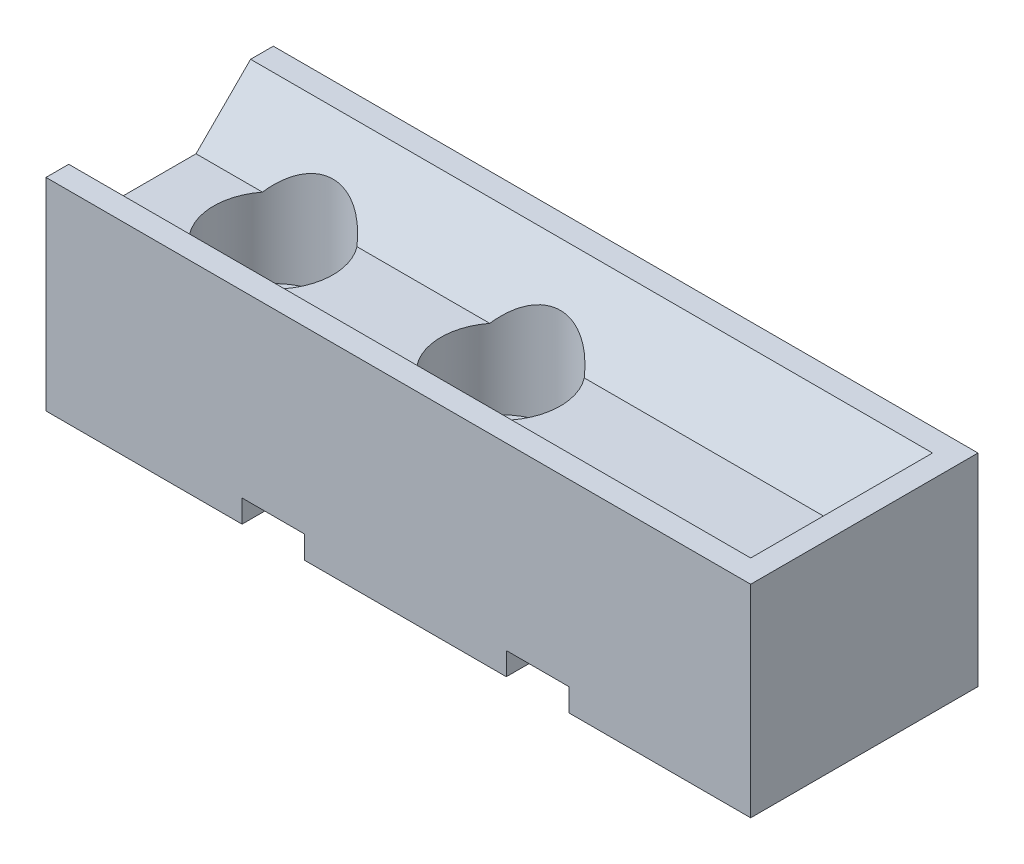
ISO-10303-21;
HEADER;
FILE_DESCRIPTION(('STEP AP214'),'2;1');
FILE_NAME('part.step','',(''),(''),'','','');
FILE_SCHEMA(('AUTOMOTIVE_DESIGN { 1 0 10303 214 1 1 1 1 }'));
ENDSEC;
DATA;
#1=APPLICATION_CONTEXT('core data for automotive mechanical design processes');
#2=APPLICATION_PROTOCOL_DEFINITION('international standard','automotive_design',2000,#1);
#3=PRODUCT_CONTEXT('',#1,'mechanical');
#4=PRODUCT('Part','Part','',(#3));
#5=PRODUCT_RELATED_PRODUCT_CATEGORY('part','',(#4));
#6=PRODUCT_DEFINITION_FORMATION('','',#4);
#7=PRODUCT_DEFINITION_CONTEXT('part definition',#1,'design');
#8=PRODUCT_DEFINITION('design','',#6,#7);
#9=PRODUCT_DEFINITION_SHAPE('','',#8);
#10=(LENGTH_UNIT() NAMED_UNIT(*) SI_UNIT(.MILLI.,.METRE.));
#11=(NAMED_UNIT(*) PLANE_ANGLE_UNIT() SI_UNIT($,.RADIAN.));
#12=(NAMED_UNIT(*) SI_UNIT($,.STERADIAN.) SOLID_ANGLE_UNIT());
#13=UNCERTAINTY_MEASURE_WITH_UNIT(LENGTH_MEASURE(1.E-05),#10,'distance_accuracy_value','');
#14=(GEOMETRIC_REPRESENTATION_CONTEXT(3) GLOBAL_UNCERTAINTY_ASSIGNED_CONTEXT((#13)) GLOBAL_UNIT_ASSIGNED_CONTEXT((#10,
#11,#12)) REPRESENTATION_CONTEXT('',''));
#15=CARTESIAN_POINT('',(0.,0.,0.));
#16=DIRECTION('',(0.,0.,1.));
#17=DIRECTION('',(1.,0.,0.));
#18=AXIS2_PLACEMENT_3D('',#15,#16,#17);
#19=CARTESIAN_POINT('',(0.,0.,0.));
#20=DIRECTION('',(0.,-1.,0.));
#21=DIRECTION('',(0.,0.,-1.));
#22=AXIS2_PLACEMENT_3D('',#19,#20,#21);
#23=PLANE('',#22);
#24=DIRECTION('',(0.,0.,-1.));
#25=VECTOR('',#24,1.);
#26=CARTESIAN_POINT('',(-13.75,0.,10.));
#27=LINE('',#26,#25);
#28=CARTESIAN_POINT('',(-13.75,0.,10.));
#29=VERTEX_POINT('',#28);
#30=CARTESIAN_POINT('',(-13.75,0.,-10.));
#31=VERTEX_POINT('',#30);
#32=EDGE_CURVE('E206',#29,#31,#27,.T.);
#33=ORIENTED_EDGE('',*,*,#32,.F.);
#34=DIRECTION('',(1.,0.,0.));
#35=VECTOR('',#34,1.);
#36=CARTESIAN_POINT('',(-31.,0.,10.));
#37=LINE('',#36,#35);
#38=CARTESIAN_POINT('',(-31.,0.,10.));
#39=VERTEX_POINT('',#38);
#40=EDGE_CURVE('E198',#39,#29,#37,.T.);
#41=ORIENTED_EDGE('',*,*,#40,.F.);
#42=DIRECTION('',(0.,0.,1.));
#43=VECTOR('',#42,1.);
#44=CARTESIAN_POINT('',(-31.,0.,10.));
#45=LINE('',#44,#43);
#46=CARTESIAN_POINT('',(-31.,0.,-10.));
#47=VERTEX_POINT('',#46);
#48=EDGE_CURVE('E368',#47,#39,#45,.T.);
#49=ORIENTED_EDGE('',*,*,#48,.F.);
#50=DIRECTION('',(-1.,0.,0.));
#51=VECTOR('',#50,1.);
#52=CARTESIAN_POINT('',(-31.,0.,-10.));
#53=LINE('',#52,#51);
#54=EDGE_CURVE('E365',#31,#47,#53,.T.);
#55=ORIENTED_EDGE('',*,*,#54,.F.);
#56=EDGE_LOOP('',(#33,#41,#49,#55));
#57=FACE_BOUND('',#56,.T.);
#58=CARTESIAN_POINT('',(-21.,0.,0.));
#59=DIRECTION('',(0.,1.,0.));
#60=DIRECTION('',(0.,0.,1.));
#61=AXIS2_PLACEMENT_3D('',#58,#59,#60);
#62=CIRCLE('',#61,2.75);
#63=CARTESIAN_POINT('',(-21.,0.,2.75));
#64=VERTEX_POINT('',#63);
#65=EDGE_CURVE('E260',#64,#64,#62,.T.);
#66=ORIENTED_EDGE('',*,*,#65,.T.);
#67=EDGE_LOOP('',(#66));
#68=FACE_BOUND('',#67,.T.);
#69=ADVANCED_FACE('F35',(#57,#68),#23,.T.);
#70=DIRECTION('',(0.,0.,-1.));
#71=VECTOR('',#70,1.);
#72=CARTESIAN_POINT('',(15.,0.,10.));
#73=LINE('',#72,#71);
#74=CARTESIAN_POINT('',(15.,0.,10.));
#75=VERTEX_POINT('',#74);
#76=CARTESIAN_POINT('',(15.,0.,-10.));
#77=VERTEX_POINT('',#76);
#78=EDGE_CURVE('E221',#75,#77,#73,.T.);
#79=ORIENTED_EDGE('',*,*,#78,.T.);
#80=CARTESIAN_POINT('',(31.,0.,-10.));
#81=VERTEX_POINT('',#80);
#82=EDGE_CURVE('E364',#81,#77,#53,.T.);
#83=ORIENTED_EDGE('',*,*,#82,.F.);
#84=DIRECTION('',(0.,0.,-1.));
#85=VECTOR('',#84,1.);
#86=CARTESIAN_POINT('',(31.,0.,10.));
#87=LINE('',#86,#85);
#88=CARTESIAN_POINT('',(31.,0.,10.));
#89=VERTEX_POINT('',#88);
#90=EDGE_CURVE('E290',#89,#81,#87,.T.);
#91=ORIENTED_EDGE('',*,*,#90,.F.);
#92=EDGE_CURVE('E373',#75,#89,#37,.T.);
#93=ORIENTED_EDGE('',*,*,#92,.F.);
#94=EDGE_LOOP('',(#79,#83,#91,#93));
#95=FACE_BOUND('',#94,.T.);
#96=ADVANCED_FACE('F334',(#95),#23,.T.);
#97=CARTESIAN_POINT('',(0.,13.,0.));
#98=DIRECTION('',(0.,-1.,0.));
#99=DIRECTION('',(0.,0.,-1.));
#100=AXIS2_PLACEMENT_3D('',#97,#98,#99);
#101=PLANE('',#100);
#102=CARTESIAN_POINT('',(-0.99999999999999,13.,0.));
#103=DIRECTION('',(0.,-1.,0.));
#104=DIRECTION('',(0.,0.,-1.));
#105=AXIS2_PLACEMENT_3D('',#102,#103,#104);
#106=CIRCLE('',#105,5.25);
#107=CARTESIAN_POINT('',(-5.16203075433134,13.,-3.2));
#108=VERTEX_POINT('',#107);
#109=CARTESIAN_POINT('',(-5.16203075433134,13.,3.2));
#110=VERTEX_POINT('',#109);
#111=EDGE_CURVE('E242',#108,#110,#106,.F.);
#112=ORIENTED_EDGE('',*,*,#111,.F.);
#113=DIRECTION('',(-1.,0.,0.));
#114=VECTOR('',#113,1.);
#115=CARTESIAN_POINT('',(39.3234608186739,13.,-3.2));
#116=LINE('',#115,#114);
#117=CARTESIAN_POINT('',(-16.8379692456686,13.,-3.2));
#118=VERTEX_POINT('',#117);
#119=EDGE_CURVE('E286',#108,#118,#116,.T.);
#120=ORIENTED_EDGE('',*,*,#119,.T.);
#121=CARTESIAN_POINT('',(-21.,13.,0.));
#122=DIRECTION('',(0.,-1.,0.));
#123=DIRECTION('',(0.,0.,-1.));
#124=AXIS2_PLACEMENT_3D('',#121,#122,#123);
#125=CIRCLE('',#124,5.25);
#126=CARTESIAN_POINT('',(-16.8379692456686,13.,3.2));
#127=VERTEX_POINT('',#126);
#128=EDGE_CURVE('E250',#127,#118,#125,.F.);
#129=ORIENTED_EDGE('',*,*,#128,.F.);
#130=DIRECTION('',(-1.,0.,0.));
#131=VECTOR('',#130,1.);
#132=CARTESIAN_POINT('',(39.3234608186739,13.,3.2));
#133=LINE('',#132,#131);
#134=EDGE_CURVE('E39',#110,#127,#133,.T.);
#135=ORIENTED_EDGE('',*,*,#134,.F.);
#136=EDGE_LOOP('',(#112,#120,#129,#135));
#137=FACE_BOUND('',#136,.T.);
#138=ADVANCED_FACE('F325',(#137),#101,.F.);
#139=CARTESIAN_POINT('',(3.16203075433136,13.,3.2));
#140=VERTEX_POINT('',#139);
#141=CARTESIAN_POINT('',(3.16203075433136,13.,-3.2));
#142=VERTEX_POINT('',#141);
#143=EDGE_CURVE('E240',#140,#142,#106,.F.);
#144=ORIENTED_EDGE('',*,*,#143,.F.);
#145=CARTESIAN_POINT('',(29.,13.,3.2));
#146=VERTEX_POINT('',#145);
#147=EDGE_CURVE('E291',#146,#140,#133,.T.);
#148=ORIENTED_EDGE('',*,*,#147,.F.);
#149=DIRECTION('',(0.,0.,1.));
#150=VECTOR('',#149,1.);
#151=CARTESIAN_POINT('',(29.,13.,10.));
#152=LINE('',#151,#150);
#153=CARTESIAN_POINT('',(29.,13.,-3.2));
#154=VERTEX_POINT('',#153);
#155=EDGE_CURVE('E263',#154,#146,#152,.T.);
#156=ORIENTED_EDGE('',*,*,#155,.F.);
#157=EDGE_CURVE('E283',#154,#142,#116,.T.);
#158=ORIENTED_EDGE('',*,*,#157,.T.);
#159=EDGE_LOOP('',(#144,#148,#156,#158));
#160=FACE_BOUND('',#159,.T.);
#161=ADVANCED_FACE('F326',(#160),#101,.F.);
#162=CARTESIAN_POINT('',(39.3234608186739,13.,3.2));
#163=DIRECTION('',(0.,0.707106781186551,-0.707106781186544));
#164=DIRECTION('',(0.,0.707106781186544,0.707106781186551));
#165=AXIS2_PLACEMENT_3D('',#162,#163,#164);
#166=PLANE('',#165);
#167=ORIENTED_EDGE('',*,*,#147,.T.);
#168=CARTESIAN_POINT('',(-0.99999999999999,9.80000000000003,0.));
#169=DIRECTION('',(0.,0.707106781186551,-0.707106781186544));
#170=DIRECTION('',(0.,-0.707106781186544,-0.707106781186551));
#171=AXIS2_PLACEMENT_3D('',#168,#169,#170);
#172=ELLIPSE('',#171,7.42462120245871,5.25);
#173=EDGE_CURVE('E243',#140,#110,#172,.F.);
#174=ORIENTED_EDGE('',*,*,#173,.T.);
#175=ORIENTED_EDGE('',*,*,#134,.T.);
#176=CARTESIAN_POINT('',(-21.,9.80000000000003,0.));
#177=DIRECTION('',(0.,0.707106781186551,-0.707106781186544));
#178=DIRECTION('',(0.,-0.707106781186544,-0.707106781186551));
#179=AXIS2_PLACEMENT_3D('',#176,#177,#178);
#180=ELLIPSE('',#179,7.42462120245871,5.25);
#181=CARTESIAN_POINT('',(-25.1620307543313,13.,3.2));
#182=VERTEX_POINT('',#181);
#183=EDGE_CURVE('E254',#127,#182,#180,.F.);
#184=ORIENTED_EDGE('',*,*,#183,.T.);
#185=CARTESIAN_POINT('',(-31.,13.,3.2));
#186=VERTEX_POINT('',#185);
#187=EDGE_CURVE('E304',#182,#186,#133,.T.);
#188=ORIENTED_EDGE('',*,*,#187,.T.);
#189=DIRECTION('',(0.,-0.707106781186544,-0.707106781186551));
#190=VECTOR('',#189,1.);
#191=CARTESIAN_POINT('',(-31.,13.,3.2));
#192=LINE('',#191,#190);
#193=CARTESIAN_POINT('',(-31.,17.8,8.));
#194=VERTEX_POINT('',#193);
#195=EDGE_CURVE('E293',#194,#186,#192,.T.);
#196=ORIENTED_EDGE('',*,*,#195,.F.);
#197=DIRECTION('',(-1.,0.,0.));
#198=VECTOR('',#197,1.);
#199=CARTESIAN_POINT('',(39.3234608186739,17.8,8.));
#200=LINE('',#199,#198);
#201=CARTESIAN_POINT('',(29.,17.8,8.));
#202=VERTEX_POINT('',#201);
#203=EDGE_CURVE('E296',#202,#194,#200,.T.);
#204=ORIENTED_EDGE('',*,*,#203,.F.);
#205=DIRECTION('',(0.,-0.707106781186544,-0.707106781186551));
#206=VECTOR('',#205,1.);
#207=CARTESIAN_POINT('',(29.,13.,3.2));
#208=LINE('',#207,#206);
#209=EDGE_CURVE('E269',#202,#146,#208,.T.);
#210=ORIENTED_EDGE('',*,*,#209,.T.);
#211=EDGE_LOOP('',(#167,#174,#175,#184,#188,#196,#204,#210));
#212=FACE_BOUND('',#211,.T.);
#213=ADVANCED_FACE('F327',(#212),#166,.T.);
#214=CARTESIAN_POINT('',(39.3234608186739,13.,-3.2));
#215=DIRECTION('',(0.,0.707106781186551,0.707106781186544));
#216=DIRECTION('',(0.,-0.707106781186544,0.707106781186551));
#217=AXIS2_PLACEMENT_3D('',#214,#215,#216);
#218=PLANE('',#217);
#219=ORIENTED_EDGE('',*,*,#119,.F.);
#220=CARTESIAN_POINT('',(-0.99999999999999,9.80000000000003,0.));
#221=DIRECTION('',(0.,0.707106781186551,0.707106781186544));
#222=DIRECTION('',(0.,-0.707106781186544,0.707106781186551));
#223=AXIS2_PLACEMENT_3D('',#220,#221,#222);
#224=ELLIPSE('',#223,7.42462120245871,5.25);
#225=EDGE_CURVE('E11',#108,#142,#224,.F.);
#226=ORIENTED_EDGE('',*,*,#225,.T.);
#227=ORIENTED_EDGE('',*,*,#157,.F.);
#228=DIRECTION('',(0.,0.707106781186544,-0.707106781186551));
#229=VECTOR('',#228,1.);
#230=CARTESIAN_POINT('',(29.,13.,-3.2));
#231=LINE('',#230,#229);
#232=CARTESIAN_POINT('',(29.,17.8,-8.));
#233=VERTEX_POINT('',#232);
#234=EDGE_CURVE('E386',#154,#233,#231,.T.);
#235=ORIENTED_EDGE('',*,*,#234,.T.);
#236=DIRECTION('',(-1.,0.,0.));
#237=VECTOR('',#236,1.);
#238=CARTESIAN_POINT('',(39.3234608186739,17.8,-8.));
#239=LINE('',#238,#237);
#240=CARTESIAN_POINT('',(-31.,17.8,-8.));
#241=VERTEX_POINT('',#240);
#242=EDGE_CURVE('E281',#233,#241,#239,.T.);
#243=ORIENTED_EDGE('',*,*,#242,.T.);
#244=DIRECTION('',(0.,0.707106781186544,-0.707106781186551));
#245=VECTOR('',#244,1.);
#246=CARTESIAN_POINT('',(-31.,13.,-3.2));
#247=LINE('',#246,#245);
#248=CARTESIAN_POINT('',(-31.,13.,-3.2));
#249=VERTEX_POINT('',#248);
#250=EDGE_CURVE('E271',#249,#241,#247,.T.);
#251=ORIENTED_EDGE('',*,*,#250,.F.);
#252=CARTESIAN_POINT('',(-25.1620307543313,13.,-3.2));
#253=VERTEX_POINT('',#252);
#254=EDGE_CURVE('E277',#253,#249,#116,.T.);
#255=ORIENTED_EDGE('',*,*,#254,.F.);
#256=CARTESIAN_POINT('',(-21.,9.80000000000003,0.));
#257=DIRECTION('',(0.,0.707106781186551,0.707106781186544));
#258=DIRECTION('',(0.,-0.707106781186544,0.707106781186551));
#259=AXIS2_PLACEMENT_3D('',#256,#257,#258);
#260=ELLIPSE('',#259,7.42462120245871,5.25);
#261=EDGE_CURVE('E45',#253,#118,#260,.F.);
#262=ORIENTED_EDGE('',*,*,#261,.T.);
#263=EDGE_LOOP('',(#219,#226,#227,#235,#243,#251,#255,#262));
#264=FACE_BOUND('',#263,.T.);
#265=ADVANCED_FACE('F315',(#264),#218,.T.);
#266=CARTESIAN_POINT('',(-0.99999999999999,0.,0.));
#267=DIRECTION('',(0.,1.,0.));
#268=DIRECTION('',(0.,0.,1.));
#269=AXIS2_PLACEMENT_3D('',#266,#267,#268);
#270=CYLINDRICAL_SURFACE('',#269,2.75);
#271=CARTESIAN_POINT('',(-0.99999999999999,0.,0.));
#272=DIRECTION('',(0.,1.,0.));
#273=DIRECTION('',(0.,0.,1.));
#274=AXIS2_PLACEMENT_3D('',#271,#272,#273);
#275=CIRCLE('',#274,2.75);
#276=CARTESIAN_POINT('',(-0.99999999999999,0.,2.75));
#277=VERTEX_POINT('',#276);
#278=EDGE_CURVE('E257',#277,#277,#275,.T.);
#279=ORIENTED_EDGE('',*,*,#278,.F.);
#280=EDGE_LOOP('',(#279));
#281=FACE_BOUND('',#280,.T.);
#282=CARTESIAN_POINT('',(-0.99999999999999,6.,0.));
#283=DIRECTION('',(0.,1.,0.));
#284=DIRECTION('',(0.,0.,1.));
#285=AXIS2_PLACEMENT_3D('',#282,#283,#284);
#286=CIRCLE('',#285,2.75);
#287=CARTESIAN_POINT('',(-0.99999999999999,6.,2.75));
#288=VERTEX_POINT('',#287);
#289=EDGE_CURVE('E239',#288,#288,#286,.F.);
#290=ORIENTED_EDGE('',*,*,#289,.F.);
#291=EDGE_LOOP('',(#290));
#292=FACE_BOUND('',#291,.T.);
#293=ADVANCED_FACE('F312',(#281,#292),#270,.F.);
#294=EDGE_CURVE('E253',#253,#182,#125,.F.);
#295=ORIENTED_EDGE('',*,*,#294,.F.);
#296=ORIENTED_EDGE('',*,*,#254,.T.);
#297=DIRECTION('',(0.,0.,1.));
#298=VECTOR('',#297,1.);
#299=CARTESIAN_POINT('',(-31.,13.,10.));
#300=LINE('',#299,#298);
#301=EDGE_CURVE('E375',#249,#186,#300,.T.);
#302=ORIENTED_EDGE('',*,*,#301,.T.);
#303=ORIENTED_EDGE('',*,*,#187,.F.);
#304=EDGE_LOOP('',(#295,#296,#302,#303));
#305=FACE_BOUND('',#304,.T.);
#306=ADVANCED_FACE('F314',(#305),#101,.F.);
#307=CARTESIAN_POINT('',(-21.,0.,0.));
#308=DIRECTION('',(0.,1.,0.));
#309=DIRECTION('',(0.,0.,1.));
#310=AXIS2_PLACEMENT_3D('',#307,#308,#309);
#311=CYLINDRICAL_SURFACE('',#310,2.75);
#312=ORIENTED_EDGE('',*,*,#65,.F.);
#313=EDGE_LOOP('',(#312));
#314=FACE_BOUND('',#313,.T.);
#315=CARTESIAN_POINT('',(-21.,6.,0.));
#316=DIRECTION('',(0.,1.,0.));
#317=DIRECTION('',(0.,0.,1.));
#318=AXIS2_PLACEMENT_3D('',#315,#316,#317);
#319=CIRCLE('',#318,2.75);
#320=CARTESIAN_POINT('',(-21.,6.,2.75));
#321=VERTEX_POINT('',#320);
#322=EDGE_CURVE('E249',#321,#321,#319,.F.);
#323=ORIENTED_EDGE('',*,*,#322,.F.);
#324=EDGE_LOOP('',(#323));
#325=FACE_BOUND('',#324,.T.);
#326=ADVANCED_FACE('F322',(#314,#325),#311,.F.);
#327=CARTESIAN_POINT('',(31.,13.,10.));
#328=DIRECTION('',(-1.,0.,0.));
#329=DIRECTION('',(0.,0.,1.));
#330=AXIS2_PLACEMENT_3D('',#327,#328,#329);
#331=PLANE('',#330);
#332=DIRECTION('',(0.,-1.,0.));
#333=VECTOR('',#332,1.);
#334=CARTESIAN_POINT('',(31.,13.,-10.));
#335=LINE('',#334,#333);
#336=CARTESIAN_POINT('',(31.,17.8,-10.));
#337=VERTEX_POINT('',#336);
#338=EDGE_CURVE('E384',#337,#81,#335,.T.);
#339=ORIENTED_EDGE('',*,*,#338,.F.);
#340=DIRECTION('',(0.,0.,1.));
#341=VECTOR('',#340,1.);
#342=CARTESIAN_POINT('',(31.,17.8,8.));
#343=LINE('',#342,#341);
#344=CARTESIAN_POINT('',(31.,17.8,10.));
#345=VERTEX_POINT('',#344);
#346=EDGE_CURVE('E287',#337,#345,#343,.T.);
#347=ORIENTED_EDGE('',*,*,#346,.T.);
#348=DIRECTION('',(0.,-1.,0.));
#349=VECTOR('',#348,1.);
#350=CARTESIAN_POINT('',(31.,13.,10.));
#351=LINE('',#350,#349);
#352=EDGE_CURVE('E376',#345,#89,#351,.T.);
#353=ORIENTED_EDGE('',*,*,#352,.T.);
#354=ORIENTED_EDGE('',*,*,#90,.T.);
#355=EDGE_LOOP('',(#339,#347,#353,#354));
#356=FACE_BOUND('',#355,.T.);
#357=ADVANCED_FACE('F37',(#356),#331,.F.);
#358=CARTESIAN_POINT('',(-31.,13.,-10.));
#359=DIRECTION('',(0.,0.,1.));
#360=DIRECTION('',(1.,0.,0.));
#361=AXIS2_PLACEMENT_3D('',#358,#359,#360);
#362=PLANE('',#361);
#363=DIRECTION('',(1.,0.,0.));
#364=VECTOR('',#363,1.);
#365=CARTESIAN_POINT('',(-13.75,2.,-10.));
#366=LINE('',#365,#364);
#367=CARTESIAN_POINT('',(-13.75,2.,-10.));
#368=VERTEX_POINT('',#367);
#369=CARTESIAN_POINT('',(-8.24999999999999,2.,-10.));
#370=VERTEX_POINT('',#369);
#371=EDGE_CURVE('E200',#368,#370,#366,.T.);
#372=ORIENTED_EDGE('',*,*,#371,.F.);
#373=DIRECTION('',(0.,1.,0.));
#374=VECTOR('',#373,1.);
#375=CARTESIAN_POINT('',(-13.75,0.,-10.));
#376=LINE('',#375,#374);
#377=EDGE_CURVE('E182',#31,#368,#376,.T.);
#378=ORIENTED_EDGE('',*,*,#377,.F.);
#379=ORIENTED_EDGE('',*,*,#54,.T.);
#380=DIRECTION('',(0.,-1.,0.));
#381=VECTOR('',#380,1.);
#382=CARTESIAN_POINT('',(-31.,13.,-10.));
#383=LINE('',#382,#381);
#384=CARTESIAN_POINT('',(-31.,17.8,-10.));
#385=VERTEX_POINT('',#384);
#386=EDGE_CURVE('E381',#385,#47,#383,.T.);
#387=ORIENTED_EDGE('',*,*,#386,.F.);
#388=DIRECTION('',(-1.,0.,0.));
#389=VECTOR('',#388,1.);
#390=CARTESIAN_POINT('',(39.3234608186739,17.8,-10.));
#391=LINE('',#390,#389);
#392=EDGE_CURVE('E278',#337,#385,#391,.T.);
#393=ORIENTED_EDGE('',*,*,#392,.F.);
#394=ORIENTED_EDGE('',*,*,#338,.T.);
#395=ORIENTED_EDGE('',*,*,#82,.T.);
#396=DIRECTION('',(0.,-1.,0.));
#397=VECTOR('',#396,1.);
#398=CARTESIAN_POINT('',(15.,0.,-10.));
#399=LINE('',#398,#397);
#400=CARTESIAN_POINT('',(15.,2.,-10.));
#401=VERTEX_POINT('',#400);
#402=EDGE_CURVE('E208',#401,#77,#399,.T.);
#403=ORIENTED_EDGE('',*,*,#402,.F.);
#404=DIRECTION('',(1.,0.,0.));
#405=VECTOR('',#404,1.);
#406=CARTESIAN_POINT('',(15.,2.,-10.));
#407=LINE('',#406,#405);
#408=CARTESIAN_POINT('',(9.50000000000001,2.,-10.));
#409=VERTEX_POINT('',#408);
#410=EDGE_CURVE('E216',#409,#401,#407,.T.);
#411=ORIENTED_EDGE('',*,*,#410,.F.);
#412=DIRECTION('',(0.,1.,0.));
#413=VECTOR('',#412,1.);
#414=CARTESIAN_POINT('',(9.50000000000001,0.,-10.));
#415=LINE('',#414,#413);
#416=CARTESIAN_POINT('',(9.50000000000001,0.,-10.));
#417=VERTEX_POINT('',#416);
#418=EDGE_CURVE('E223',#417,#409,#415,.T.);
#419=ORIENTED_EDGE('',*,*,#418,.F.);
#420=CARTESIAN_POINT('',(-8.24999999999999,0.,-10.));
#421=VERTEX_POINT('',#420);
#422=EDGE_CURVE('E359',#417,#421,#53,.T.);
#423=ORIENTED_EDGE('',*,*,#422,.T.);
#424=DIRECTION('',(0.,-1.,0.));
#425=VECTOR('',#424,1.);
#426=CARTESIAN_POINT('',(-8.24999999999999,0.,-10.));
#427=LINE('',#426,#425);
#428=EDGE_CURVE('E52',#370,#421,#427,.T.);
#429=ORIENTED_EDGE('',*,*,#428,.F.);
#430=EDGE_LOOP('',(#372,#378,#379,#387,#393,#394,#395,#403,#411,#419,#423,#429));
#431=FACE_BOUND('',#430,.T.);
#432=ADVANCED_FACE('F362',(#431),#362,.F.);
#433=CARTESIAN_POINT('',(-31.,13.,10.));
#434=DIRECTION('',(1.,0.,0.));
#435=DIRECTION('',(0.,0.,-1.));
#436=AXIS2_PLACEMENT_3D('',#433,#434,#435);
#437=PLANE('',#436);
#438=ORIENTED_EDGE('',*,*,#48,.T.);
#439=DIRECTION('',(0.,-1.,0.));
#440=VECTOR('',#439,1.);
#441=CARTESIAN_POINT('',(-31.,13.,10.));
#442=LINE('',#441,#440);
#443=CARTESIAN_POINT('',(-31.,17.8,10.));
#444=VERTEX_POINT('',#443);
#445=EDGE_CURVE('E379',#444,#39,#442,.T.);
#446=ORIENTED_EDGE('',*,*,#445,.F.);
#447=DIRECTION('',(0.,0.,-1.));
#448=VECTOR('',#447,1.);
#449=CARTESIAN_POINT('',(-31.,17.8,8.));
#450=LINE('',#449,#448);
#451=EDGE_CURVE('E280',#444,#194,#450,.T.);
#452=ORIENTED_EDGE('',*,*,#451,.T.);
#453=ORIENTED_EDGE('',*,*,#195,.T.);
#454=ORIENTED_EDGE('',*,*,#301,.F.);
#455=ORIENTED_EDGE('',*,*,#250,.T.);
#456=DIRECTION('',(0.,0.,-1.));
#457=VECTOR('',#456,1.);
#458=CARTESIAN_POINT('',(-31.,17.8,-8.));
#459=LINE('',#458,#457);
#460=EDGE_CURVE('E274',#241,#385,#459,.T.);
#461=ORIENTED_EDGE('',*,*,#460,.T.);
#462=ORIENTED_EDGE('',*,*,#386,.T.);
#463=EDGE_LOOP('',(#438,#446,#452,#453,#454,#455,#461,#462));
#464=FACE_BOUND('',#463,.T.);
#465=ADVANCED_FACE('F354',(#464),#437,.F.);
#466=CARTESIAN_POINT('',(-31.,13.,10.));
#467=DIRECTION('',(0.,0.,-1.));
#468=DIRECTION('',(-1.,0.,0.));
#469=AXIS2_PLACEMENT_3D('',#466,#467,#468);
#470=PLANE('',#469);
#471=ORIENTED_EDGE('',*,*,#40,.T.);
#472=DIRECTION('',(0.,1.,0.));
#473=VECTOR('',#472,1.);
#474=CARTESIAN_POINT('',(-13.75,0.,10.));
#475=LINE('',#474,#473);
#476=CARTESIAN_POINT('',(-13.75,2.,10.));
#477=VERTEX_POINT('',#476);
#478=EDGE_CURVE('E179',#29,#477,#475,.T.);
#479=ORIENTED_EDGE('',*,*,#478,.T.);
#480=DIRECTION('',(1.,0.,0.));
#481=VECTOR('',#480,1.);
#482=CARTESIAN_POINT('',(-13.75,2.,10.));
#483=LINE('',#482,#481);
#484=CARTESIAN_POINT('',(-8.24999999999999,2.,10.));
#485=VERTEX_POINT('',#484);
#486=EDGE_CURVE('E190',#477,#485,#483,.T.);
#487=ORIENTED_EDGE('',*,*,#486,.T.);
#488=DIRECTION('',(0.,-1.,0.));
#489=VECTOR('',#488,1.);
#490=CARTESIAN_POINT('',(-8.24999999999999,0.,10.));
#491=LINE('',#490,#489);
#492=CARTESIAN_POINT('',(-8.24999999999999,0.,10.));
#493=VERTEX_POINT('',#492);
#494=EDGE_CURVE('E187',#485,#493,#491,.T.);
#495=ORIENTED_EDGE('',*,*,#494,.T.);
#496=CARTESIAN_POINT('',(9.50000000000001,0.,10.));
#497=VERTEX_POINT('',#496);
#498=EDGE_CURVE('E60',#493,#497,#37,.T.);
#499=ORIENTED_EDGE('',*,*,#498,.T.);
#500=DIRECTION('',(0.,1.,0.));
#501=VECTOR('',#500,1.);
#502=CARTESIAN_POINT('',(9.50000000000001,0.,10.));
#503=LINE('',#502,#501);
#504=CARTESIAN_POINT('',(9.50000000000001,2.,10.));
#505=VERTEX_POINT('',#504);
#506=EDGE_CURVE('E215',#497,#505,#503,.T.);
#507=ORIENTED_EDGE('',*,*,#506,.T.);
#508=DIRECTION('',(1.,0.,0.));
#509=VECTOR('',#508,1.);
#510=CARTESIAN_POINT('',(15.,2.,10.));
#511=LINE('',#510,#509);
#512=CARTESIAN_POINT('',(15.,2.,10.));
#513=VERTEX_POINT('',#512);
#514=EDGE_CURVE('E218',#505,#513,#511,.T.);
#515=ORIENTED_EDGE('',*,*,#514,.T.);
#516=DIRECTION('',(0.,-1.,0.));
#517=VECTOR('',#516,1.);
#518=CARTESIAN_POINT('',(15.,0.,10.));
#519=LINE('',#518,#517);
#520=EDGE_CURVE('E212',#513,#75,#519,.T.);
#521=ORIENTED_EDGE('',*,*,#520,.T.);
#522=ORIENTED_EDGE('',*,*,#92,.T.);
#523=ORIENTED_EDGE('',*,*,#352,.F.);
#524=DIRECTION('',(-1.,0.,0.));
#525=VECTOR('',#524,1.);
#526=CARTESIAN_POINT('',(39.3234608186739,17.8,10.));
#527=LINE('',#526,#525);
#528=EDGE_CURVE('E389',#345,#444,#527,.T.);
#529=ORIENTED_EDGE('',*,*,#528,.T.);
#530=ORIENTED_EDGE('',*,*,#445,.T.);
#531=EDGE_LOOP('',(#471,#479,#487,#495,#499,#507,#515,#521,#522,#523,#529,#530));
#532=FACE_BOUND('',#531,.T.);
#533=ADVANCED_FACE('F195',(#532),#470,.F.);
#534=DIRECTION('',(0.,0.,-1.));
#535=VECTOR('',#534,1.);
#536=CARTESIAN_POINT('',(-8.24999999999999,0.,10.));
#537=LINE('',#536,#535);
#538=EDGE_CURVE('E209',#493,#421,#537,.T.);
#539=ORIENTED_EDGE('',*,*,#538,.T.);
#540=ORIENTED_EDGE('',*,*,#422,.F.);
#541=DIRECTION('',(0.,0.,-1.));
#542=VECTOR('',#541,1.);
#543=CARTESIAN_POINT('',(9.50000000000001,0.,10.));
#544=LINE('',#543,#542);
#545=EDGE_CURVE('E233',#497,#417,#544,.T.);
#546=ORIENTED_EDGE('',*,*,#545,.F.);
#547=ORIENTED_EDGE('',*,*,#498,.F.);
#548=EDGE_LOOP('',(#539,#540,#546,#547));
#549=FACE_BOUND('',#548,.T.);
#550=ORIENTED_EDGE('',*,*,#278,.T.);
#551=EDGE_LOOP('',(#550));
#552=FACE_BOUND('',#551,.T.);
#553=ADVANCED_FACE('F337',(#549,#552),#23,.T.);
#554=CARTESIAN_POINT('',(39.3234608186739,17.8,8.));
#555=DIRECTION('',(0.,1.,0.));
#556=DIRECTION('',(0.,0.,1.));
#557=AXIS2_PLACEMENT_3D('',#554,#555,#556);
#558=PLANE('',#557);
#559=ORIENTED_EDGE('',*,*,#346,.F.);
#560=ORIENTED_EDGE('',*,*,#392,.T.);
#561=ORIENTED_EDGE('',*,*,#460,.F.);
#562=ORIENTED_EDGE('',*,*,#242,.F.);
#563=DIRECTION('',(0.,0.,1.));
#564=VECTOR('',#563,1.);
#565=CARTESIAN_POINT('',(29.,17.8,10.));
#566=LINE('',#565,#564);
#567=EDGE_CURVE('E266',#233,#202,#566,.T.);
#568=ORIENTED_EDGE('',*,*,#567,.T.);
#569=ORIENTED_EDGE('',*,*,#203,.T.);
#570=ORIENTED_EDGE('',*,*,#451,.F.);
#571=ORIENTED_EDGE('',*,*,#528,.F.);
#572=EDGE_LOOP('',(#559,#560,#561,#562,#568,#569,#570,#571));
#573=FACE_BOUND('',#572,.T.);
#574=ADVANCED_FACE('F345',(#573),#558,.T.);
#575=CARTESIAN_POINT('',(29.,37.8997512422417,10.));
#576=DIRECTION('',(1.,0.,0.));
#577=DIRECTION('',(0.,0.,-1.));
#578=AXIS2_PLACEMENT_3D('',#575,#576,#577);
#579=PLANE('',#578);
#580=ORIENTED_EDGE('',*,*,#209,.F.);
#581=ORIENTED_EDGE('',*,*,#567,.F.);
#582=ORIENTED_EDGE('',*,*,#234,.F.);
#583=ORIENTED_EDGE('',*,*,#155,.T.);
#584=EDGE_LOOP('',(#580,#581,#582,#583));
#585=FACE_BOUND('',#584,.T.);
#586=ADVANCED_FACE('F351',(#585),#579,.F.);
#587=CARTESIAN_POINT('',(-21.,6.,0.));
#588=DIRECTION('',(0.,1.,0.));
#589=DIRECTION('',(0.,0.,1.));
#590=AXIS2_PLACEMENT_3D('',#587,#588,#589);
#591=PLANE('',#590);
#592=CARTESIAN_POINT('',(-21.,6.,0.));
#593=DIRECTION('',(0.,1.,0.));
#594=DIRECTION('',(0.,0.,1.));
#595=AXIS2_PLACEMENT_3D('',#592,#593,#594);
#596=CIRCLE('',#595,5.25);
#597=CARTESIAN_POINT('',(-21.,6.,5.25));
#598=VERTEX_POINT('',#597);
#599=EDGE_CURVE('E246',#598,#598,#596,.T.);
#600=ORIENTED_EDGE('',*,*,#599,.T.);
#601=EDGE_LOOP('',(#600));
#602=FACE_BOUND('',#601,.T.);
#603=ORIENTED_EDGE('',*,*,#322,.T.);
#604=EDGE_LOOP('',(#603));
#605=FACE_BOUND('',#604,.T.);
#606=ADVANCED_FACE('F454',(#602,#605),#591,.T.);
#607=CARTESIAN_POINT('',(-21.,17.800025,0.));
#608=DIRECTION('',(0.,-1.,0.));
#609=DIRECTION('',(0.,0.,-1.));
#610=AXIS2_PLACEMENT_3D('',#607,#608,#609);
#611=CYLINDRICAL_SURFACE('',#610,5.25);
#612=ORIENTED_EDGE('',*,*,#128,.T.);
#613=ORIENTED_EDGE('',*,*,#261,.F.);
#614=ORIENTED_EDGE('',*,*,#294,.T.);
#615=ORIENTED_EDGE('',*,*,#183,.F.);
#616=EDGE_LOOP('',(#612,#613,#614,#615));
#617=FACE_BOUND('',#616,.T.);
#618=ORIENTED_EDGE('',*,*,#599,.F.);
#619=EDGE_LOOP('',(#618));
#620=FACE_BOUND('',#619,.T.);
#621=ADVANCED_FACE('F449',(#617,#620),#611,.F.);
#622=CARTESIAN_POINT('',(-0.99999999999999,6.,0.));
#623=DIRECTION('',(0.,1.,0.));
#624=DIRECTION('',(0.,0.,1.));
#625=AXIS2_PLACEMENT_3D('',#622,#623,#624);
#626=PLANE('',#625);
#627=CARTESIAN_POINT('',(-0.99999999999999,6.,0.));
#628=DIRECTION('',(0.,1.,0.));
#629=DIRECTION('',(0.,0.,1.));
#630=AXIS2_PLACEMENT_3D('',#627,#628,#629);
#631=CIRCLE('',#630,5.25);
#632=CARTESIAN_POINT('',(-0.99999999999999,6.,5.25));
#633=VERTEX_POINT('',#632);
#634=EDGE_CURVE('E230',#633,#633,#631,.T.);
#635=ORIENTED_EDGE('',*,*,#634,.T.);
#636=EDGE_LOOP('',(#635));
#637=FACE_BOUND('',#636,.T.);
#638=ORIENTED_EDGE('',*,*,#289,.T.);
#639=EDGE_LOOP('',(#638));
#640=FACE_BOUND('',#639,.T.);
#641=ADVANCED_FACE('F310',(#637,#640),#626,.T.);
#642=CARTESIAN_POINT('',(-0.99999999999999,17.800025,0.));
#643=DIRECTION('',(0.,-1.,0.));
#644=DIRECTION('',(0.,0.,-1.));
#645=AXIS2_PLACEMENT_3D('',#642,#643,#644);
#646=CYLINDRICAL_SURFACE('',#645,5.25);
#647=ORIENTED_EDGE('',*,*,#143,.T.);
#648=ORIENTED_EDGE('',*,*,#225,.F.);
#649=ORIENTED_EDGE('',*,*,#111,.T.);
#650=ORIENTED_EDGE('',*,*,#173,.F.);
#651=EDGE_LOOP('',(#647,#648,#649,#650));
#652=FACE_BOUND('',#651,.T.);
#653=ORIENTED_EDGE('',*,*,#634,.F.);
#654=EDGE_LOOP('',(#653));
#655=FACE_BOUND('',#654,.T.);
#656=ADVANCED_FACE('F446',(#652,#655),#646,.F.);
#657=CARTESIAN_POINT('',(15.,0.,10.));
#658=DIRECTION('',(1.,0.,0.));
#659=DIRECTION('',(0.,0.,-1.));
#660=AXIS2_PLACEMENT_3D('',#657,#658,#659);
#661=PLANE('',#660);
#662=ORIENTED_EDGE('',*,*,#402,.T.);
#663=ORIENTED_EDGE('',*,*,#78,.F.);
#664=ORIENTED_EDGE('',*,*,#520,.F.);
#665=DIRECTION('',(0.,0.,-1.));
#666=VECTOR('',#665,1.);
#667=CARTESIAN_POINT('',(15.,2.,10.));
#668=LINE('',#667,#666);
#669=EDGE_CURVE('E228',#513,#401,#668,.T.);
#670=ORIENTED_EDGE('',*,*,#669,.T.);
#671=EDGE_LOOP('',(#662,#663,#664,#670));
#672=FACE_BOUND('',#671,.T.);
#673=ADVANCED_FACE('F429',(#672),#661,.F.);
#674=CARTESIAN_POINT('',(15.,2.,10.));
#675=DIRECTION('',(0.,1.,0.));
#676=DIRECTION('',(0.,0.,1.));
#677=AXIS2_PLACEMENT_3D('',#674,#675,#676);
#678=PLANE('',#677);
#679=ORIENTED_EDGE('',*,*,#410,.T.);
#680=ORIENTED_EDGE('',*,*,#669,.F.);
#681=ORIENTED_EDGE('',*,*,#514,.F.);
#682=DIRECTION('',(0.,0.,-1.));
#683=VECTOR('',#682,1.);
#684=CARTESIAN_POINT('',(9.50000000000001,2.,10.));
#685=LINE('',#684,#683);
#686=EDGE_CURVE('E231',#505,#409,#685,.T.);
#687=ORIENTED_EDGE('',*,*,#686,.T.);
#688=EDGE_LOOP('',(#679,#680,#681,#687));
#689=FACE_BOUND('',#688,.T.);
#690=ADVANCED_FACE('F431',(#689),#678,.F.);
#691=CARTESIAN_POINT('',(9.50000000000001,0.,10.));
#692=DIRECTION('',(-1.,0.,0.));
#693=DIRECTION('',(0.,0.,1.));
#694=AXIS2_PLACEMENT_3D('',#691,#692,#693);
#695=PLANE('',#694);
#696=ORIENTED_EDGE('',*,*,#418,.T.);
#697=ORIENTED_EDGE('',*,*,#686,.F.);
#698=ORIENTED_EDGE('',*,*,#506,.F.);
#699=ORIENTED_EDGE('',*,*,#545,.T.);
#700=EDGE_LOOP('',(#696,#697,#698,#699));
#701=FACE_BOUND('',#700,.T.);
#702=ADVANCED_FACE('F433',(#701),#695,.F.);
#703=CARTESIAN_POINT('',(-13.75,0.,10.));
#704=DIRECTION('',(-1.,0.,0.));
#705=DIRECTION('',(0.,0.,1.));
#706=AXIS2_PLACEMENT_3D('',#703,#704,#705);
#707=PLANE('',#706);
#708=ORIENTED_EDGE('',*,*,#377,.T.);
#709=DIRECTION('',(0.,0.,-1.));
#710=VECTOR('',#709,1.);
#711=CARTESIAN_POINT('',(-13.75,2.,10.));
#712=LINE('',#711,#710);
#713=EDGE_CURVE('E175',#477,#368,#712,.T.);
#714=ORIENTED_EDGE('',*,*,#713,.F.);
#715=ORIENTED_EDGE('',*,*,#478,.F.);
#716=ORIENTED_EDGE('',*,*,#32,.T.);
#717=EDGE_LOOP('',(#708,#714,#715,#716));
#718=FACE_BOUND('',#717,.T.);
#719=ADVANCED_FACE('F177',(#718),#707,.F.);
#720=CARTESIAN_POINT('',(-8.24999999999999,0.,10.));
#721=DIRECTION('',(1.,0.,0.));
#722=DIRECTION('',(0.,0.,-1.));
#723=AXIS2_PLACEMENT_3D('',#720,#721,#722);
#724=PLANE('',#723);
#725=ORIENTED_EDGE('',*,*,#428,.T.);
#726=ORIENTED_EDGE('',*,*,#538,.F.);
#727=ORIENTED_EDGE('',*,*,#494,.F.);
#728=DIRECTION('',(0.,0.,-1.));
#729=VECTOR('',#728,1.);
#730=CARTESIAN_POINT('',(-8.24999999999999,2.,10.));
#731=LINE('',#730,#729);
#732=EDGE_CURVE('E186',#485,#370,#731,.T.);
#733=ORIENTED_EDGE('',*,*,#732,.T.);
#734=EDGE_LOOP('',(#725,#726,#727,#733));
#735=FACE_BOUND('',#734,.T.);
#736=ADVANCED_FACE('F440',(#735),#724,.F.);
#737=CARTESIAN_POINT('',(-13.75,2.,10.));
#738=DIRECTION('',(0.,1.,0.));
#739=DIRECTION('',(-1.,0.,0.));
#740=AXIS2_PLACEMENT_3D('',#737,#738,#739);
#741=PLANE('',#740);
#742=ORIENTED_EDGE('',*,*,#371,.T.);
#743=ORIENTED_EDGE('',*,*,#732,.F.);
#744=ORIENTED_EDGE('',*,*,#486,.F.);
#745=ORIENTED_EDGE('',*,*,#713,.T.);
#746=EDGE_LOOP('',(#742,#743,#744,#745));
#747=FACE_BOUND('',#746,.T.);
#748=ADVANCED_FACE('F191',(#747),#741,.F.);
#749=CLOSED_SHELL('',(#69,#96,#138,#161,#213,#265,#293,#306,#326,#357,#432,#465,#533,#553,#574,
#586,#606,#621,#641,#656,#673,#690,#702,#719,#736,#748));
#750=MANIFOLD_SOLID_BREP('B2',#749);
#751=ADVANCED_BREP_SHAPE_REPRESENTATION('',(#18,#750),#14);
#752=SHAPE_DEFINITION_REPRESENTATION(#9,#751);
ENDSEC;
END-ISO-10303-21;
